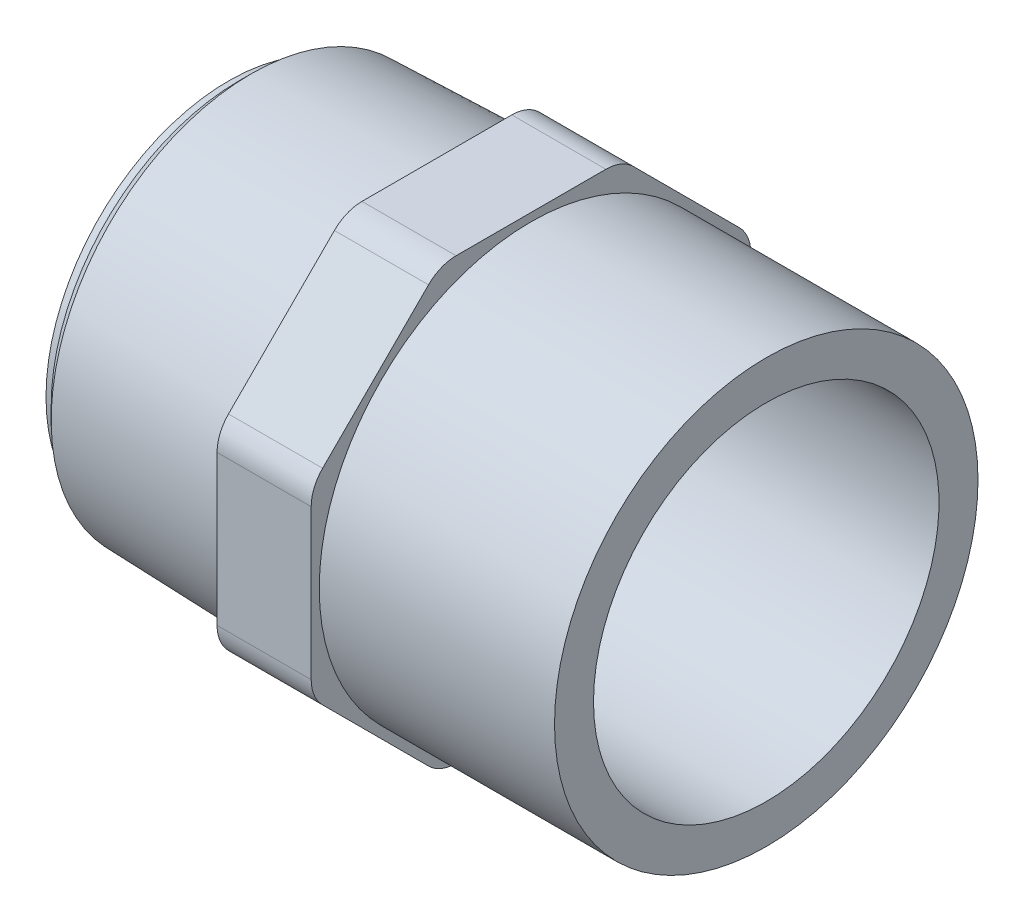
ISO-10303-21;
HEADER;
FILE_DESCRIPTION(('STEP AP214'),'2;1');
FILE_NAME('part.step','',(''),(''),'','','');
FILE_SCHEMA(('AUTOMOTIVE_DESIGN { 1 0 10303 214 1 1 1 1 }'));
ENDSEC;
DATA;
#1=APPLICATION_CONTEXT('core data for automotive mechanical design processes');
#2=APPLICATION_PROTOCOL_DEFINITION('international standard','automotive_design',2000,#1);
#3=PRODUCT_CONTEXT('',#1,'mechanical');
#4=PRODUCT('Part','Part','',(#3));
#5=PRODUCT_RELATED_PRODUCT_CATEGORY('part','',(#4));
#6=PRODUCT_DEFINITION_FORMATION('','',#4);
#7=PRODUCT_DEFINITION_CONTEXT('part definition',#1,'design');
#8=PRODUCT_DEFINITION('design','',#6,#7);
#9=PRODUCT_DEFINITION_SHAPE('','',#8);
#10=(LENGTH_UNIT() NAMED_UNIT(*) SI_UNIT(.MILLI.,.METRE.));
#11=(NAMED_UNIT(*) PLANE_ANGLE_UNIT() SI_UNIT($,.RADIAN.));
#12=(NAMED_UNIT(*) SI_UNIT($,.STERADIAN.) SOLID_ANGLE_UNIT());
#13=UNCERTAINTY_MEASURE_WITH_UNIT(LENGTH_MEASURE(1.E-05),#10,'distance_accuracy_value','');
#14=(GEOMETRIC_REPRESENTATION_CONTEXT(3) GLOBAL_UNCERTAINTY_ASSIGNED_CONTEXT((#13)) GLOBAL_UNIT_ASSIGNED_CONTEXT((#10,
#11,#12)) REPRESENTATION_CONTEXT('',''));
#15=CARTESIAN_POINT('',(0.,0.,0.));
#16=DIRECTION('',(0.,0.,1.));
#17=DIRECTION('',(1.,0.,0.));
#18=AXIS2_PLACEMENT_3D('',#15,#16,#17);
#19=CARTESIAN_POINT('',(-49.,-32.7,32.7));
#20=DIRECTION('',(-1.,0.,0.));
#21=DIRECTION('',(0.,1.,0.));
#22=AXIS2_PLACEMENT_3D('',#19,#20,#21);
#23=PLANE('',#22);
#24=CARTESIAN_POINT('',(-49.,0.,0.));
#25=DIRECTION('',(1.,0.,0.));
#26=DIRECTION('',(0.,0.,-1.));
#27=AXIS2_PLACEMENT_3D('',#24,#25,#26);
#28=CIRCLE('',#27,30.6172714934728);
#29=CARTESIAN_POINT('',(-49.,0.,-30.6172714934728));
#30=VERTEX_POINT('',#29);
#31=EDGE_CURVE('E18',#30,#30,#28,.F.);
#32=ORIENTED_EDGE('',*,*,#31,.F.);
#33=EDGE_LOOP('',(#32));
#34=FACE_BOUND('',#33,.T.);
#35=CARTESIAN_POINT('',(-49.,-26.8999999999999,11.1423448278362));
#36=DIRECTION('',(1.,0.,0.));
#37=DIRECTION('',(0.,0.,-1.));
#38=AXIS2_PLACEMENT_3D('',#35,#36,#37);
#39=CIRCLE('',#38,5.80000000000005);
#40=CARTESIAN_POINT('',(-49.,-31.001219330882,15.2435641587182));
#41=VERTEX_POINT('',#40);
#42=CARTESIAN_POINT('',(-49.,-32.7,11.1423448278362));
#43=VERTEX_POINT('',#42);
#44=EDGE_CURVE('E235',#41,#43,#39,.T.);
#45=ORIENTED_EDGE('',*,*,#44,.F.);
#46=DIRECTION('',(0.,-0.707106781186547,-0.707106781186548));
#47=VECTOR('',#46,1.);
#48=CARTESIAN_POINT('',(-49.,-23.1223917448001,23.1223917448001));
#49=LINE('',#48,#47);
#50=CARTESIAN_POINT('',(-49.,-15.2435641587182,31.001219330882));
#51=VERTEX_POINT('',#50);
#52=EDGE_CURVE('E132',#51,#41,#49,.T.);
#53=ORIENTED_EDGE('',*,*,#52,.F.);
#54=CARTESIAN_POINT('',(-49.,-11.1423448278363,26.9));
#55=DIRECTION('',(1.,0.,0.));
#56=DIRECTION('',(0.,0.,-1.));
#57=AXIS2_PLACEMENT_3D('',#54,#55,#56);
#58=CIRCLE('',#57,5.8);
#59=CARTESIAN_POINT('',(-49.,-11.1423448278363,32.7));
#60=VERTEX_POINT('',#59);
#61=EDGE_CURVE('E126',#60,#51,#58,.T.);
#62=ORIENTED_EDGE('',*,*,#61,.F.);
#63=DIRECTION('',(0.,-1.,0.));
#64=VECTOR('',#63,1.);
#65=CARTESIAN_POINT('',(-49.,0.,32.7));
#66=LINE('',#65,#64);
#67=CARTESIAN_POINT('',(-49.,11.1423448278362,32.7));
#68=VERTEX_POINT('',#67);
#69=EDGE_CURVE('E131',#68,#60,#66,.T.);
#70=ORIENTED_EDGE('',*,*,#69,.F.);
#71=CARTESIAN_POINT('',(-49.,11.1423448278362,26.9));
#72=DIRECTION('',(1.,0.,0.));
#73=DIRECTION('',(0.,0.,-1.));
#74=AXIS2_PLACEMENT_3D('',#71,#72,#73);
#75=CIRCLE('',#74,5.80000000000004);
#76=CARTESIAN_POINT('',(-49.,15.2435641587182,31.001219330882));
#77=VERTEX_POINT('',#76);
#78=EDGE_CURVE('E147',#77,#68,#75,.T.);
#79=ORIENTED_EDGE('',*,*,#78,.F.);
#80=DIRECTION('',(0.,-0.707106781186548,0.707106781186547));
#81=VECTOR('',#80,1.);
#82=CARTESIAN_POINT('',(-49.,23.1223917448001,23.1223917448001));
#83=LINE('',#82,#81);
#84=CARTESIAN_POINT('',(-49.,31.001219330882,15.2435641587182));
#85=VERTEX_POINT('',#84);
#86=EDGE_CURVE('E151',#85,#77,#83,.T.);
#87=ORIENTED_EDGE('',*,*,#86,.F.);
#88=CARTESIAN_POINT('',(-49.,26.9,11.1423448278363));
#89=DIRECTION('',(1.,0.,0.));
#90=DIRECTION('',(0.,0.,-1.));
#91=AXIS2_PLACEMENT_3D('',#88,#89,#90);
#92=CIRCLE('',#91,5.80000000000004);
#93=CARTESIAN_POINT('',(-49.,32.7,11.1423448278363));
#94=VERTEX_POINT('',#93);
#95=EDGE_CURVE('E225',#94,#85,#92,.T.);
#96=ORIENTED_EDGE('',*,*,#95,.F.);
#97=DIRECTION('',(0.,0.,1.));
#98=VECTOR('',#97,1.);
#99=CARTESIAN_POINT('',(-49.,32.7,0.));
#100=LINE('',#99,#98);
#101=CARTESIAN_POINT('',(-49.,32.7,-11.1423448278363));
#102=VERTEX_POINT('',#101);
#103=EDGE_CURVE('E155',#102,#94,#100,.T.);
#104=ORIENTED_EDGE('',*,*,#103,.F.);
#105=CARTESIAN_POINT('',(-49.,26.9,-11.1423448278363));
#106=DIRECTION('',(1.,0.,0.));
#107=DIRECTION('',(0.,0.,-1.));
#108=AXIS2_PLACEMENT_3D('',#105,#106,#107);
#109=CIRCLE('',#108,5.79999999999996);
#110=CARTESIAN_POINT('',(-49.,31.001219330882,-15.2435641587182));
#111=VERTEX_POINT('',#110);
#112=EDGE_CURVE('E227',#111,#102,#109,.T.);
#113=ORIENTED_EDGE('',*,*,#112,.F.);
#114=DIRECTION('',(0.,0.707106781186548,0.707106781186547));
#115=VECTOR('',#114,1.);
#116=CARTESIAN_POINT('',(-49.,23.1223917448001,-23.1223917448001));
#117=LINE('',#116,#115);
#118=CARTESIAN_POINT('',(-49.,15.2435641587182,-31.001219330882));
#119=VERTEX_POINT('',#118);
#120=EDGE_CURVE('E159',#119,#111,#117,.T.);
#121=ORIENTED_EDGE('',*,*,#120,.F.);
#122=CARTESIAN_POINT('',(-49.,11.1423448278362,-26.8999999999999));
#123=DIRECTION('',(1.,0.,0.));
#124=DIRECTION('',(0.,0.,-1.));
#125=AXIS2_PLACEMENT_3D('',#122,#123,#124);
#126=CIRCLE('',#125,5.80000000000007);
#127=CARTESIAN_POINT('',(-49.,11.1423448278363,-32.7));
#128=VERTEX_POINT('',#127);
#129=EDGE_CURVE('E229',#128,#119,#126,.T.);
#130=ORIENTED_EDGE('',*,*,#129,.F.);
#131=DIRECTION('',(0.,1.,0.));
#132=VECTOR('',#131,1.);
#133=CARTESIAN_POINT('',(-49.,0.,-32.7));
#134=LINE('',#133,#132);
#135=CARTESIAN_POINT('',(-49.,-11.1423448278363,-32.7));
#136=VERTEX_POINT('',#135);
#137=EDGE_CURVE('E163',#136,#128,#134,.T.);
#138=ORIENTED_EDGE('',*,*,#137,.F.);
#139=CARTESIAN_POINT('',(-49.,-11.1423448278363,-26.9));
#140=DIRECTION('',(1.,0.,0.));
#141=DIRECTION('',(0.,0.,-1.));
#142=AXIS2_PLACEMENT_3D('',#139,#140,#141);
#143=CIRCLE('',#142,5.79999999999998);
#144=CARTESIAN_POINT('',(-49.,-15.2435641587182,-31.001219330882));
#145=VERTEX_POINT('',#144);
#146=EDGE_CURVE('E231',#145,#136,#143,.T.);
#147=ORIENTED_EDGE('',*,*,#146,.F.);
#148=DIRECTION('',(0.,0.707106781186548,-0.707106781186548));
#149=VECTOR('',#148,1.);
#150=CARTESIAN_POINT('',(-49.,-23.1223917448001,-23.1223917448001));
#151=LINE('',#150,#149);
#152=CARTESIAN_POINT('',(-49.,-31.001219330882,-15.2435641587182));
#153=VERTEX_POINT('',#152);
#154=EDGE_CURVE('E167',#153,#145,#151,.T.);
#155=ORIENTED_EDGE('',*,*,#154,.F.);
#156=CARTESIAN_POINT('',(-49.,-26.9,-11.1423448278363));
#157=DIRECTION('',(1.,0.,0.));
#158=DIRECTION('',(0.,0.,-1.));
#159=AXIS2_PLACEMENT_3D('',#156,#157,#158);
#160=CIRCLE('',#159,5.79999999999997);
#161=CARTESIAN_POINT('',(-49.,-32.7,-11.1423448278363));
#162=VERTEX_POINT('',#161);
#163=EDGE_CURVE('E233',#162,#153,#160,.T.);
#164=ORIENTED_EDGE('',*,*,#163,.F.);
#165=DIRECTION('',(0.,0.,-1.));
#166=VECTOR('',#165,1.);
#167=CARTESIAN_POINT('',(-49.,-32.7,0.));
#168=LINE('',#167,#166);
#169=EDGE_CURVE('E171',#43,#162,#168,.T.);
#170=ORIENTED_EDGE('',*,*,#169,.F.);
#171=EDGE_LOOP('',(#45,#53,#62,#70,#79,#87,#96,#104,#113,#121,#130,#138,#147,#155,#164,#170));
#172=FACE_BOUND('',#171,.T.);
#173=ADVANCED_FACE('F15',(#34,#172),#23,.T.);
#174=CARTESIAN_POINT('',(-76.6230979570329,0.,0.));
#175=DIRECTION('',(1.,0.,0.));
#176=DIRECTION('',(0.,0.,-1.));
#177=AXIS2_PLACEMENT_3D('',#174,#175,#176);
#178=CONICAL_SURFACE('',#177,29.7569020429671,0.0311366738555793);
#179=CARTESIAN_POINT('',(-76.6230979570329,0.,0.));
#180=DIRECTION('',(-1.,0.,0.));
#181=DIRECTION('',(0.,1.,0.));
#182=AXIS2_PLACEMENT_3D('',#179,#180,#181);
#183=CIRCLE('',#182,29.7569020429671);
#184=CARTESIAN_POINT('',(-76.6230979570329,29.7569020429671,0.));
#185=VERTEX_POINT('',#184);
#186=EDGE_CURVE('E143',#185,#185,#183,.T.);
#187=ORIENTED_EDGE('',*,*,#186,.F.);
#188=EDGE_LOOP('',(#187));
#189=FACE_BOUND('',#188,.T.);
#190=ORIENTED_EDGE('',*,*,#31,.T.);
#191=EDGE_LOOP('',(#190));
#192=FACE_BOUND('',#191,.T.);
#193=ADVANCED_FACE('F537',(#189,#192),#178,.T.);
#194=CARTESIAN_POINT('',(-35.,-11.1423448278363,26.9));
#195=DIRECTION('',(1.,0.,0.));
#196=DIRECTION('',(0.,0.,-1.));
#197=AXIS2_PLACEMENT_3D('',#194,#195,#196);
#198=CYLINDRICAL_SURFACE('',#197,5.8);
#199=ORIENTED_EDGE('',*,*,#61,.T.);
#200=DIRECTION('',(1.,0.,0.));
#201=VECTOR('',#200,1.);
#202=CARTESIAN_POINT('',(-49.,-15.2435641587182,31.001219330882));
#203=LINE('',#202,#201);
#204=CARTESIAN_POINT('',(-35.,-15.2435641587182,31.001219330882));
#205=VERTEX_POINT('',#204);
#206=EDGE_CURVE('E135',#205,#51,#203,.F.);
#207=ORIENTED_EDGE('',*,*,#206,.F.);
#208=CARTESIAN_POINT('',(-35.,-11.1423448278363,26.9));
#209=DIRECTION('',(1.,0.,0.));
#210=DIRECTION('',(0.,0.,-1.));
#211=AXIS2_PLACEMENT_3D('',#208,#209,#210);
#212=CIRCLE('',#211,5.8);
#213=CARTESIAN_POINT('',(-35.,-11.1423448278363,32.7));
#214=VERTEX_POINT('',#213);
#215=EDGE_CURVE('E140',#214,#205,#212,.T.);
#216=ORIENTED_EDGE('',*,*,#215,.F.);
#217=DIRECTION('',(1.,0.,0.));
#218=VECTOR('',#217,1.);
#219=CARTESIAN_POINT('',(-49.,-11.1423448278363,32.7));
#220=LINE('',#219,#218);
#221=EDGE_CURVE('E137',#60,#214,#220,.T.);
#222=ORIENTED_EDGE('',*,*,#221,.F.);
#223=EDGE_LOOP('',(#199,#207,#216,#222));
#224=FACE_BOUND('',#223,.T.);
#225=ADVANCED_FACE('F138',(#224),#198,.T.);
#226=CARTESIAN_POINT('',(-49.,-15.2435641587182,31.001219330882));
#227=DIRECTION('',(0.,-0.707106781186548,0.707106781186547));
#228=DIRECTION('',(0.,-0.707106781186547,-0.707106781186548));
#229=AXIS2_PLACEMENT_3D('',#226,#227,#228);
#230=PLANE('',#229);
#231=ORIENTED_EDGE('',*,*,#52,.T.);
#232=DIRECTION('',(-1.,0.,0.));
#233=VECTOR('',#232,1.);
#234=CARTESIAN_POINT('',(-42.,-31.001219330882,15.2435641587182));
#235=LINE('',#234,#233);
#236=CARTESIAN_POINT('',(-35.,-31.001219330882,15.2435641587182));
#237=VERTEX_POINT('',#236);
#238=EDGE_CURVE('E175',#237,#41,#235,.T.);
#239=ORIENTED_EDGE('',*,*,#238,.F.);
#240=CARTESIAN_POINT('',(-35.,-15.2435641587182,31.001219330882));
#241=CARTESIAN_POINT('',(-35.,-15.9001331242251,30.3446503653751));
#242=CARTESIAN_POINT('',(-35.,-16.5567020897319,29.6880813998683));
#243=CARTESIAN_POINT('',(-35.,-17.8698400207455,28.3749434688547));
#244=CARTESIAN_POINT('',(-35.,-18.5264089862523,27.7183745033479));
#245=CARTESIAN_POINT('',(-35.,-19.839546917266,26.4052365723342));
#246=CARTESIAN_POINT('',(-35.,-20.4961158827728,25.7486676068274));
#247=CARTESIAN_POINT('',(-35.,-21.8092538137865,24.4355296758137));
#248=CARTESIAN_POINT('',(-35.,-22.4658227792933,23.7789607103069));
#249=CARTESIAN_POINT('',(-35.,-23.7789607103069,22.4658227792933));
#250=CARTESIAN_POINT('',(-35.,-24.4355296758137,21.8092538137864));
#251=CARTESIAN_POINT('',(-35.,-25.7486676068274,20.4961158827728));
#252=CARTESIAN_POINT('',(-35.,-26.4052365723342,19.839546917266));
#253=CARTESIAN_POINT('',(-35.,-27.7183745033478,18.5264089862523));
#254=CARTESIAN_POINT('',(-35.,-28.3749434688547,17.8698400207455));
#255=CARTESIAN_POINT('',(-35.,-29.6880813998683,16.5567020897319));
#256=CARTESIAN_POINT('',(-35.,-30.3446503653751,15.900133124225));
#257=CARTESIAN_POINT('',(-35.,-31.001219330882,15.2435641587182));
#258=B_SPLINE_CURVE_WITH_KNOTS('',3,(#240,#241,#242,#243,#244,#245,#246,#247,#248,#249,#250,
#251,#252,#253,#254,#255,#256,#257),.UNSPECIFIED.,.F.,.F.,(4,2,2,2,2,2,2,2,4),(0.,
2.78558620695906,5.57117241391813,8.35675862087719,11.1423448278363,13.9279310347953,
16.7135172417544,19.4991034487134,22.2846896556725),.UNSPECIFIED.);
#259=EDGE_CURVE('E222',#205,#237,#258,.T.);
#260=ORIENTED_EDGE('',*,*,#259,.F.);
#261=ORIENTED_EDGE('',*,*,#206,.T.);
#262=EDGE_LOOP('',(#231,#239,#260,#261));
#263=FACE_BOUND('',#262,.T.);
#264=ADVANCED_FACE('F369',(#263),#230,.T.);
#265=CARTESIAN_POINT('',(-35.,-26.8999999999999,11.1423448278362));
#266=DIRECTION('',(1.,0.,0.));
#267=DIRECTION('',(0.,0.,-1.));
#268=AXIS2_PLACEMENT_3D('',#265,#266,#267);
#269=CYLINDRICAL_SURFACE('',#268,5.80000000000005);
#270=ORIENTED_EDGE('',*,*,#44,.T.);
#271=DIRECTION('',(1.,0.,0.));
#272=VECTOR('',#271,1.);
#273=CARTESIAN_POINT('',(-49.,-32.7,11.1423448278362));
#274=LINE('',#273,#272);
#275=CARTESIAN_POINT('',(-35.,-32.7,11.1423448278362));
#276=VERTEX_POINT('',#275);
#277=EDGE_CURVE('E174',#276,#43,#274,.F.);
#278=ORIENTED_EDGE('',*,*,#277,.F.);
#279=CARTESIAN_POINT('',(-35.,-26.8999999999999,11.1423448278362));
#280=DIRECTION('',(1.,0.,0.));
#281=DIRECTION('',(0.,0.,-1.));
#282=AXIS2_PLACEMENT_3D('',#279,#280,#281);
#283=CIRCLE('',#282,5.80000000000005);
#284=EDGE_CURVE('E219',#237,#276,#283,.T.);
#285=ORIENTED_EDGE('',*,*,#284,.F.);
#286=ORIENTED_EDGE('',*,*,#238,.T.);
#287=EDGE_LOOP('',(#270,#278,#285,#286));
#288=FACE_BOUND('',#287,.T.);
#289=ADVANCED_FACE('F370',(#288),#269,.T.);
#290=CARTESIAN_POINT('',(-49.,-32.7,11.1423448278362));
#291=DIRECTION('',(0.,-1.,0.));
#292=DIRECTION('',(0.,0.,-1.));
#293=AXIS2_PLACEMENT_3D('',#290,#291,#292);
#294=PLANE('',#293);
#295=ORIENTED_EDGE('',*,*,#169,.T.);
#296=DIRECTION('',(-1.,0.,0.));
#297=VECTOR('',#296,1.);
#298=CARTESIAN_POINT('',(-42.,-32.7,-11.1423448278363));
#299=LINE('',#298,#297);
#300=CARTESIAN_POINT('',(-35.,-32.7,-11.1423448278363));
#301=VERTEX_POINT('',#300);
#302=EDGE_CURVE('E173',#301,#162,#299,.T.);
#303=ORIENTED_EDGE('',*,*,#302,.F.);
#304=DIRECTION('',(0.,0.,-1.));
#305=VECTOR('',#304,1.);
#306=CARTESIAN_POINT('',(-35.,-32.7,32.7));
#307=LINE('',#306,#305);
#308=EDGE_CURVE('E218',#276,#301,#307,.T.);
#309=ORIENTED_EDGE('',*,*,#308,.F.);
#310=ORIENTED_EDGE('',*,*,#277,.T.);
#311=EDGE_LOOP('',(#295,#303,#309,#310));
#312=FACE_BOUND('',#311,.T.);
#313=ADVANCED_FACE('F326',(#312),#294,.T.);
#314=CARTESIAN_POINT('',(-35.,-26.9,-11.1423448278363));
#315=DIRECTION('',(1.,0.,0.));
#316=DIRECTION('',(0.,0.,-1.));
#317=AXIS2_PLACEMENT_3D('',#314,#315,#316);
#318=CYLINDRICAL_SURFACE('',#317,5.79999999999997);
#319=ORIENTED_EDGE('',*,*,#163,.T.);
#320=DIRECTION('',(1.,0.,0.));
#321=VECTOR('',#320,1.);
#322=CARTESIAN_POINT('',(-49.,-31.001219330882,-15.2435641587182));
#323=LINE('',#322,#321);
#324=CARTESIAN_POINT('',(-35.,-31.001219330882,-15.2435641587182));
#325=VERTEX_POINT('',#324);
#326=EDGE_CURVE('E170',#325,#153,#323,.F.);
#327=ORIENTED_EDGE('',*,*,#326,.F.);
#328=CARTESIAN_POINT('',(-35.,-26.9,-11.1423448278363));
#329=DIRECTION('',(1.,0.,0.));
#330=DIRECTION('',(0.,0.,-1.));
#331=AXIS2_PLACEMENT_3D('',#328,#329,#330);
#332=CIRCLE('',#331,5.79999999999997);
#333=EDGE_CURVE('E215',#301,#325,#332,.T.);
#334=ORIENTED_EDGE('',*,*,#333,.F.);
#335=ORIENTED_EDGE('',*,*,#302,.T.);
#336=EDGE_LOOP('',(#319,#327,#334,#335));
#337=FACE_BOUND('',#336,.T.);
#338=ADVANCED_FACE('F329',(#337),#318,.T.);
#339=CARTESIAN_POINT('',(-49.,-31.001219330882,-15.2435641587182));
#340=DIRECTION('',(0.,-0.707106781186547,-0.707106781186547));
#341=DIRECTION('',(0.,0.707106781186547,-0.707106781186547));
#342=AXIS2_PLACEMENT_3D('',#339,#340,#341);
#343=PLANE('',#342);
#344=ORIENTED_EDGE('',*,*,#154,.T.);
#345=DIRECTION('',(-1.,0.,0.));
#346=VECTOR('',#345,1.);
#347=CARTESIAN_POINT('',(-42.,-15.2435641587182,-31.001219330882));
#348=LINE('',#347,#346);
#349=CARTESIAN_POINT('',(-35.,-15.2435641587182,-31.001219330882));
#350=VERTEX_POINT('',#349);
#351=EDGE_CURVE('E169',#350,#145,#348,.T.);
#352=ORIENTED_EDGE('',*,*,#351,.F.);
#353=CARTESIAN_POINT('',(-35.,-31.001219330882,-15.2435641587182));
#354=CARTESIAN_POINT('',(-35.,-30.3446503653751,-15.9001331242251));
#355=CARTESIAN_POINT('',(-35.,-29.6880813998683,-16.5567020897319));
#356=CARTESIAN_POINT('',(-35.,-28.3749434688547,-17.8698400207455));
#357=CARTESIAN_POINT('',(-35.,-27.7183745033478,-18.5264089862524));
#358=CARTESIAN_POINT('',(-35.,-26.4052365723342,-19.839546917266));
#359=CARTESIAN_POINT('',(-35.,-25.7486676068274,-20.4961158827728));
#360=CARTESIAN_POINT('',(-35.,-24.4355296758137,-21.8092538137865));
#361=CARTESIAN_POINT('',(-35.,-23.7789607103069,-22.4658227792933));
#362=CARTESIAN_POINT('',(-35.,-22.4658227792933,-23.7789607103069));
#363=CARTESIAN_POINT('',(-35.,-21.8092538137864,-24.4355296758138));
#364=CARTESIAN_POINT('',(-35.,-20.4961158827728,-25.7486676068274));
#365=CARTESIAN_POINT('',(-35.,-19.839546917266,-26.4052365723342));
#366=CARTESIAN_POINT('',(-35.,-18.5264089862523,-27.7183745033479));
#367=CARTESIAN_POINT('',(-35.,-17.8698400207455,-28.3749434688547));
#368=CARTESIAN_POINT('',(-35.,-16.5567020897319,-29.6880813998683));
#369=CARTESIAN_POINT('',(-35.,-15.900133124225,-30.3446503653751));
#370=CARTESIAN_POINT('',(-35.,-15.2435641587182,-31.001219330882));
#371=B_SPLINE_CURVE_WITH_KNOTS('',3,(#353,#354,#355,#356,#357,#358,#359,#360,#361,#362,#363,
#364,#365,#366,#367,#368,#369,#370),.UNSPECIFIED.,.F.,.F.,(4,2,2,2,2,2,2,2,4),(0.,
2.78558620695906,5.57117241391813,8.35675862087718,11.1423448278362,13.9279310347953,
16.7135172417544,19.4991034487134,22.2846896556725),.UNSPECIFIED.);
#372=EDGE_CURVE('E214',#325,#350,#371,.T.);
#373=ORIENTED_EDGE('',*,*,#372,.F.);
#374=ORIENTED_EDGE('',*,*,#326,.T.);
#375=EDGE_LOOP('',(#344,#352,#373,#374));
#376=FACE_BOUND('',#375,.T.);
#377=ADVANCED_FACE('F333',(#376),#343,.T.);
#378=CARTESIAN_POINT('',(-35.,-11.1423448278363,-26.9));
#379=DIRECTION('',(1.,0.,0.));
#380=DIRECTION('',(0.,0.,-1.));
#381=AXIS2_PLACEMENT_3D('',#378,#379,#380);
#382=CYLINDRICAL_SURFACE('',#381,5.79999999999998);
#383=ORIENTED_EDGE('',*,*,#146,.T.);
#384=DIRECTION('',(1.,0.,0.));
#385=VECTOR('',#384,1.);
#386=CARTESIAN_POINT('',(-49.,-11.1423448278363,-32.7));
#387=LINE('',#386,#385);
#388=CARTESIAN_POINT('',(-35.,-11.1423448278363,-32.7));
#389=VERTEX_POINT('',#388);
#390=EDGE_CURVE('E166',#389,#136,#387,.F.);
#391=ORIENTED_EDGE('',*,*,#390,.F.);
#392=CARTESIAN_POINT('',(-35.,-11.1423448278363,-26.9));
#393=DIRECTION('',(1.,0.,0.));
#394=DIRECTION('',(0.,0.,-1.));
#395=AXIS2_PLACEMENT_3D('',#392,#393,#394);
#396=CIRCLE('',#395,5.79999999999998);
#397=EDGE_CURVE('E211',#350,#389,#396,.T.);
#398=ORIENTED_EDGE('',*,*,#397,.F.);
#399=ORIENTED_EDGE('',*,*,#351,.T.);
#400=EDGE_LOOP('',(#383,#391,#398,#399));
#401=FACE_BOUND('',#400,.T.);
#402=ADVANCED_FACE('F337',(#401),#382,.T.);
#403=CARTESIAN_POINT('',(-49.,-11.1423448278363,-32.7));
#404=DIRECTION('',(0.,0.,-1.));
#405=DIRECTION('',(0.,1.,0.));
#406=AXIS2_PLACEMENT_3D('',#403,#404,#405);
#407=PLANE('',#406);
#408=ORIENTED_EDGE('',*,*,#137,.T.);
#409=DIRECTION('',(-1.,0.,0.));
#410=VECTOR('',#409,1.);
#411=CARTESIAN_POINT('',(-42.,11.1423448278363,-32.7));
#412=LINE('',#411,#410);
#413=CARTESIAN_POINT('',(-35.,11.1423448278363,-32.7));
#414=VERTEX_POINT('',#413);
#415=EDGE_CURVE('E165',#414,#128,#412,.T.);
#416=ORIENTED_EDGE('',*,*,#415,.F.);
#417=DIRECTION('',(0.,1.,0.));
#418=VECTOR('',#417,1.);
#419=CARTESIAN_POINT('',(-35.,0.,-32.7));
#420=LINE('',#419,#418);
#421=EDGE_CURVE('E210',#389,#414,#420,.T.);
#422=ORIENTED_EDGE('',*,*,#421,.F.);
#423=ORIENTED_EDGE('',*,*,#390,.T.);
#424=EDGE_LOOP('',(#408,#416,#422,#423));
#425=FACE_BOUND('',#424,.T.);
#426=ADVANCED_FACE('F341',(#425),#407,.T.);
#427=CARTESIAN_POINT('',(-35.,11.1423448278362,-26.8999999999999));
#428=DIRECTION('',(1.,0.,0.));
#429=DIRECTION('',(0.,0.,-1.));
#430=AXIS2_PLACEMENT_3D('',#427,#428,#429);
#431=CYLINDRICAL_SURFACE('',#430,5.80000000000007);
#432=ORIENTED_EDGE('',*,*,#129,.T.);
#433=DIRECTION('',(1.,0.,0.));
#434=VECTOR('',#433,1.);
#435=CARTESIAN_POINT('',(-49.,15.2435641587182,-31.001219330882));
#436=LINE('',#435,#434);
#437=CARTESIAN_POINT('',(-35.,15.2435641587182,-31.001219330882));
#438=VERTEX_POINT('',#437);
#439=EDGE_CURVE('E162',#438,#119,#436,.F.);
#440=ORIENTED_EDGE('',*,*,#439,.F.);
#441=CARTESIAN_POINT('',(-35.,11.1423448278362,-26.8999999999999));
#442=DIRECTION('',(1.,0.,0.));
#443=DIRECTION('',(0.,0.,-1.));
#444=AXIS2_PLACEMENT_3D('',#441,#442,#443);
#445=CIRCLE('',#444,5.80000000000007);
#446=EDGE_CURVE('E207',#414,#438,#445,.T.);
#447=ORIENTED_EDGE('',*,*,#446,.F.);
#448=ORIENTED_EDGE('',*,*,#415,.T.);
#449=EDGE_LOOP('',(#432,#440,#447,#448));
#450=FACE_BOUND('',#449,.T.);
#451=ADVANCED_FACE('F345',(#450),#431,.T.);
#452=CARTESIAN_POINT('',(-49.,15.2435641587182,-31.001219330882));
#453=DIRECTION('',(0.,0.707106781186547,-0.707106781186548));
#454=DIRECTION('',(0.,0.707106781186548,0.707106781186547));
#455=AXIS2_PLACEMENT_3D('',#452,#453,#454);
#456=PLANE('',#455);
#457=ORIENTED_EDGE('',*,*,#120,.T.);
#458=DIRECTION('',(-1.,0.,0.));
#459=VECTOR('',#458,1.);
#460=CARTESIAN_POINT('',(-42.,31.001219330882,-15.2435641587182));
#461=LINE('',#460,#459);
#462=CARTESIAN_POINT('',(-35.,31.001219330882,-15.2435641587182));
#463=VERTEX_POINT('',#462);
#464=EDGE_CURVE('E161',#463,#111,#461,.T.);
#465=ORIENTED_EDGE('',*,*,#464,.F.);
#466=CARTESIAN_POINT('',(-35.,15.2435641587182,-31.001219330882));
#467=CARTESIAN_POINT('',(-35.,15.9001331242251,-30.3446503653752));
#468=CARTESIAN_POINT('',(-35.,16.5567020897319,-29.6880813998683));
#469=CARTESIAN_POINT('',(-35.,17.8698400207455,-28.3749434688547));
#470=CARTESIAN_POINT('',(-35.,18.5264089862523,-27.7183745033479));
#471=CARTESIAN_POINT('',(-35.,19.839546917266,-26.4052365723342));
#472=CARTESIAN_POINT('',(-35.,20.4961158827728,-25.7486676068274));
#473=CARTESIAN_POINT('',(-35.,21.8092538137865,-24.4355296758137));
#474=CARTESIAN_POINT('',(-35.,22.4658227792933,-23.7789607103069));
#475=CARTESIAN_POINT('',(-35.,23.7789607103069,-22.4658227792933));
#476=CARTESIAN_POINT('',(-35.,24.4355296758137,-21.8092538137864));
#477=CARTESIAN_POINT('',(-35.,25.7486676068274,-20.4961158827728));
#478=CARTESIAN_POINT('',(-35.,26.4052365723342,-19.839546917266));
#479=CARTESIAN_POINT('',(-35.,27.7183745033479,-18.5264089862523));
#480=CARTESIAN_POINT('',(-35.,28.3749434688547,-17.8698400207455));
#481=CARTESIAN_POINT('',(-35.,29.6880813998683,-16.5567020897319));
#482=CARTESIAN_POINT('',(-35.,30.3446503653751,-15.900133124225));
#483=CARTESIAN_POINT('',(-35.,31.001219330882,-15.2435641587182));
#484=B_SPLINE_CURVE_WITH_KNOTS('',3,(#466,#467,#468,#469,#470,#471,#472,#473,#474,#475,#476,
#477,#478,#479,#480,#481,#482,#483),.UNSPECIFIED.,.F.,.F.,(4,2,2,2,2,2,2,2,4),(0.,
2.78558620695906,5.57117241391812,8.35675862087719,11.1423448278363,13.9279310347953,
16.7135172417544,19.4991034487135,22.2846896556725),.UNSPECIFIED.);
#485=EDGE_CURVE('E206',#438,#463,#484,.T.);
#486=ORIENTED_EDGE('',*,*,#485,.F.);
#487=ORIENTED_EDGE('',*,*,#439,.T.);
#488=EDGE_LOOP('',(#457,#465,#486,#487));
#489=FACE_BOUND('',#488,.T.);
#490=ADVANCED_FACE('F349',(#489),#456,.T.);
#491=CARTESIAN_POINT('',(-35.,26.9,-11.1423448278363));
#492=DIRECTION('',(1.,0.,0.));
#493=DIRECTION('',(0.,0.,-1.));
#494=AXIS2_PLACEMENT_3D('',#491,#492,#493);
#495=CYLINDRICAL_SURFACE('',#494,5.79999999999996);
#496=ORIENTED_EDGE('',*,*,#112,.T.);
#497=DIRECTION('',(1.,0.,0.));
#498=VECTOR('',#497,1.);
#499=CARTESIAN_POINT('',(-49.,32.7,-11.1423448278363));
#500=LINE('',#499,#498);
#501=CARTESIAN_POINT('',(-35.,32.7,-11.1423448278363));
#502=VERTEX_POINT('',#501);
#503=EDGE_CURVE('E158',#502,#102,#500,.F.);
#504=ORIENTED_EDGE('',*,*,#503,.F.);
#505=CARTESIAN_POINT('',(-35.,26.9,-11.1423448278363));
#506=DIRECTION('',(1.,0.,0.));
#507=DIRECTION('',(0.,0.,-1.));
#508=AXIS2_PLACEMENT_3D('',#505,#506,#507);
#509=CIRCLE('',#508,5.79999999999996);
#510=EDGE_CURVE('E203',#463,#502,#509,.T.);
#511=ORIENTED_EDGE('',*,*,#510,.F.);
#512=ORIENTED_EDGE('',*,*,#464,.T.);
#513=EDGE_LOOP('',(#496,#504,#511,#512));
#514=FACE_BOUND('',#513,.T.);
#515=ADVANCED_FACE('F353',(#514),#495,.T.);
#516=CARTESIAN_POINT('',(-49.,32.7,-11.1423448278363));
#517=DIRECTION('',(0.,1.,0.));
#518=DIRECTION('',(0.,0.,1.));
#519=AXIS2_PLACEMENT_3D('',#516,#517,#518);
#520=PLANE('',#519);
#521=ORIENTED_EDGE('',*,*,#103,.T.);
#522=DIRECTION('',(-1.,0.,0.));
#523=VECTOR('',#522,1.);
#524=CARTESIAN_POINT('',(-42.,32.7,11.1423448278363));
#525=LINE('',#524,#523);
#526=CARTESIAN_POINT('',(-35.,32.7,11.1423448278363));
#527=VERTEX_POINT('',#526);
#528=EDGE_CURVE('E157',#527,#94,#525,.T.);
#529=ORIENTED_EDGE('',*,*,#528,.F.);
#530=DIRECTION('',(0.,0.,-1.));
#531=VECTOR('',#530,1.);
#532=CARTESIAN_POINT('',(-35.,32.7,32.7));
#533=LINE('',#532,#531);
#534=EDGE_CURVE('E202',#502,#527,#533,.F.);
#535=ORIENTED_EDGE('',*,*,#534,.F.);
#536=ORIENTED_EDGE('',*,*,#503,.T.);
#537=EDGE_LOOP('',(#521,#529,#535,#536));
#538=FACE_BOUND('',#537,.T.);
#539=ADVANCED_FACE('F357',(#538),#520,.T.);
#540=CARTESIAN_POINT('',(-35.,26.9,11.1423448278363));
#541=DIRECTION('',(1.,0.,0.));
#542=DIRECTION('',(0.,0.,-1.));
#543=AXIS2_PLACEMENT_3D('',#540,#541,#542);
#544=CYLINDRICAL_SURFACE('',#543,5.80000000000004);
#545=ORIENTED_EDGE('',*,*,#95,.T.);
#546=DIRECTION('',(1.,0.,0.));
#547=VECTOR('',#546,1.);
#548=CARTESIAN_POINT('',(-49.,31.001219330882,15.2435641587182));
#549=LINE('',#548,#547);
#550=CARTESIAN_POINT('',(-35.,31.001219330882,15.2435641587182));
#551=VERTEX_POINT('',#550);
#552=EDGE_CURVE('E154',#551,#85,#549,.F.);
#553=ORIENTED_EDGE('',*,*,#552,.F.);
#554=CARTESIAN_POINT('',(-35.,26.9,11.1423448278363));
#555=DIRECTION('',(1.,0.,0.));
#556=DIRECTION('',(0.,0.,-1.));
#557=AXIS2_PLACEMENT_3D('',#554,#555,#556);
#558=CIRCLE('',#557,5.80000000000004);
#559=EDGE_CURVE('E199',#527,#551,#558,.T.);
#560=ORIENTED_EDGE('',*,*,#559,.F.);
#561=ORIENTED_EDGE('',*,*,#528,.T.);
#562=EDGE_LOOP('',(#545,#553,#560,#561));
#563=FACE_BOUND('',#562,.T.);
#564=ADVANCED_FACE('F361',(#563),#544,.T.);
#565=CARTESIAN_POINT('',(-49.,31.001219330882,15.2435641587182));
#566=DIRECTION('',(0.,0.707106781186547,0.707106781186548));
#567=DIRECTION('',(0.,-0.707106781186548,0.707106781186547));
#568=AXIS2_PLACEMENT_3D('',#565,#566,#567);
#569=PLANE('',#568);
#570=ORIENTED_EDGE('',*,*,#86,.T.);
#571=DIRECTION('',(-1.,0.,0.));
#572=VECTOR('',#571,1.);
#573=CARTESIAN_POINT('',(-42.,15.2435641587182,31.001219330882));
#574=LINE('',#573,#572);
#575=CARTESIAN_POINT('',(-35.,15.2435641587182,31.001219330882));
#576=VERTEX_POINT('',#575);
#577=EDGE_CURVE('E153',#576,#77,#574,.T.);
#578=ORIENTED_EDGE('',*,*,#577,.F.);
#579=CARTESIAN_POINT('',(-35.,31.001219330882,15.2435641587182));
#580=CARTESIAN_POINT('',(-35.,30.3446503653752,15.9001331242251));
#581=CARTESIAN_POINT('',(-35.,29.6880813998683,16.5567020897319));
#582=CARTESIAN_POINT('',(-35.,28.3749434688547,17.8698400207455));
#583=CARTESIAN_POINT('',(-35.,27.7183745033479,18.5264089862523));
#584=CARTESIAN_POINT('',(-35.,26.4052365723342,19.839546917266));
#585=CARTESIAN_POINT('',(-35.,25.7486676068274,20.4961158827728));
#586=CARTESIAN_POINT('',(-35.,24.4355296758138,21.8092538137865));
#587=CARTESIAN_POINT('',(-35.,23.7789607103069,22.4658227792933));
#588=CARTESIAN_POINT('',(-35.,22.4658227792933,23.7789607103069));
#589=CARTESIAN_POINT('',(-35.,21.8092538137865,24.4355296758138));
#590=CARTESIAN_POINT('',(-35.,20.4961158827728,25.7486676068274));
#591=CARTESIAN_POINT('',(-35.,19.839546917266,26.4052365723342));
#592=CARTESIAN_POINT('',(-35.,18.5264089862524,27.7183745033479));
#593=CARTESIAN_POINT('',(-35.,17.8698400207455,28.3749434688547));
#594=CARTESIAN_POINT('',(-35.,16.5567020897319,29.6880813998683));
#595=CARTESIAN_POINT('',(-35.,15.9001331242251,30.3446503653752));
#596=CARTESIAN_POINT('',(-35.,15.2435641587182,31.001219330882));
#597=B_SPLINE_CURVE_WITH_KNOTS('',3,(#579,#580,#581,#582,#583,#584,#585,#586,#587,#588,#589,
#590,#591,#592,#593,#594,#595,#596),.UNSPECIFIED.,.F.,.F.,(4,2,2,2,2,2,2,2,4),(0.,
2.78558620695906,5.57117241391812,8.35675862087719,11.1423448278363,13.9279310347953,
16.7135172417544,19.4991034487134,22.2846896556725),.UNSPECIFIED.);
#598=EDGE_CURVE('E198',#551,#576,#597,.T.);
#599=ORIENTED_EDGE('',*,*,#598,.F.);
#600=ORIENTED_EDGE('',*,*,#552,.T.);
#601=EDGE_LOOP('',(#570,#578,#599,#600));
#602=FACE_BOUND('',#601,.T.);
#603=ADVANCED_FACE('F365',(#602),#569,.T.);
#604=CARTESIAN_POINT('',(-35.,11.1423448278362,26.9));
#605=DIRECTION('',(1.,0.,0.));
#606=DIRECTION('',(0.,0.,-1.));
#607=AXIS2_PLACEMENT_3D('',#604,#605,#606);
#608=CYLINDRICAL_SURFACE('',#607,5.80000000000004);
#609=ORIENTED_EDGE('',*,*,#78,.T.);
#610=DIRECTION('',(1.,0.,0.));
#611=VECTOR('',#610,1.);
#612=CARTESIAN_POINT('',(-49.,11.1423448278363,32.7));
#613=LINE('',#612,#611);
#614=CARTESIAN_POINT('',(-35.,11.1423448278362,32.7));
#615=VERTEX_POINT('',#614);
#616=EDGE_CURVE('E33',#615,#68,#613,.F.);
#617=ORIENTED_EDGE('',*,*,#616,.F.);
#618=CARTESIAN_POINT('',(-35.,11.1423448278362,26.9));
#619=DIRECTION('',(1.,0.,0.));
#620=DIRECTION('',(0.,0.,-1.));
#621=AXIS2_PLACEMENT_3D('',#618,#619,#620);
#622=CIRCLE('',#621,5.80000000000004);
#623=EDGE_CURVE('E195',#576,#615,#622,.T.);
#624=ORIENTED_EDGE('',*,*,#623,.F.);
#625=ORIENTED_EDGE('',*,*,#577,.T.);
#626=EDGE_LOOP('',(#609,#617,#624,#625));
#627=FACE_BOUND('',#626,.T.);
#628=ADVANCED_FACE('F366',(#627),#608,.T.);
#629=CARTESIAN_POINT('',(-49.,11.1423448278363,32.7));
#630=DIRECTION('',(0.,0.,1.));
#631=DIRECTION('',(0.,-1.,0.));
#632=AXIS2_PLACEMENT_3D('',#629,#630,#631);
#633=PLANE('',#632);
#634=ORIENTED_EDGE('',*,*,#69,.T.);
#635=ORIENTED_EDGE('',*,*,#221,.T.);
#636=DIRECTION('',(0.,-1.,0.));
#637=VECTOR('',#636,1.);
#638=CARTESIAN_POINT('',(-35.,0.,32.7));
#639=LINE('',#638,#637);
#640=EDGE_CURVE('E194',#615,#214,#639,.T.);
#641=ORIENTED_EDGE('',*,*,#640,.F.);
#642=ORIENTED_EDGE('',*,*,#616,.T.);
#643=EDGE_LOOP('',(#634,#635,#641,#642));
#644=FACE_BOUND('',#643,.T.);
#645=ADVANCED_FACE('F145',(#644),#633,.T.);
#646=CARTESIAN_POINT('',(-78.45,0.,0.));
#647=DIRECTION('',(1.,0.,0.));
#648=DIRECTION('',(0.,0.,-1.));
#649=AXIS2_PLACEMENT_3D('',#646,#647,#648);
#650=CONICAL_SURFACE('',#649,27.93,0.78539816339745);
#651=CARTESIAN_POINT('',(-78.45,0.,0.));
#652=DIRECTION('',(1.,0.,0.));
#653=DIRECTION('',(0.,0.,-1.));
#654=AXIS2_PLACEMENT_3D('',#651,#652,#653);
#655=CIRCLE('',#654,27.93);
#656=CARTESIAN_POINT('',(-78.45,0.,-27.93));
#657=VERTEX_POINT('',#656);
#658=EDGE_CURVE('E191',#657,#657,#655,.F.);
#659=ORIENTED_EDGE('',*,*,#658,.F.);
#660=EDGE_LOOP('',(#659));
#661=FACE_BOUND('',#660,.T.);
#662=ORIENTED_EDGE('',*,*,#186,.T.);
#663=EDGE_LOOP('',(#662));
#664=FACE_BOUND('',#663,.T.);
#665=ADVANCED_FACE('F412',(#661,#664),#650,.T.);
#666=CARTESIAN_POINT('',(-35.,32.7,32.7));
#667=DIRECTION('',(1.,0.,0.));
#668=DIRECTION('',(0.,-1.,0.));
#669=AXIS2_PLACEMENT_3D('',#666,#667,#668);
#670=PLANE('',#669);
#671=CARTESIAN_POINT('',(-35.,0.,0.));
#672=DIRECTION('',(-1.,0.,0.));
#673=DIRECTION('',(0.,0.,1.));
#674=AXIS2_PLACEMENT_3D('',#671,#672,#673);
#675=CIRCLE('',#674,31.5);
#676=CARTESIAN_POINT('',(-35.,0.,31.5));
#677=VERTEX_POINT('',#676);
#678=EDGE_CURVE('E188',#677,#677,#675,.F.);
#679=ORIENTED_EDGE('',*,*,#678,.F.);
#680=EDGE_LOOP('',(#679));
#681=FACE_BOUND('',#680,.T.);
#682=ORIENTED_EDGE('',*,*,#623,.T.);
#683=ORIENTED_EDGE('',*,*,#640,.T.);
#684=ORIENTED_EDGE('',*,*,#215,.T.);
#685=ORIENTED_EDGE('',*,*,#259,.T.);
#686=ORIENTED_EDGE('',*,*,#284,.T.);
#687=ORIENTED_EDGE('',*,*,#308,.T.);
#688=ORIENTED_EDGE('',*,*,#333,.T.);
#689=ORIENTED_EDGE('',*,*,#372,.T.);
#690=ORIENTED_EDGE('',*,*,#397,.T.);
#691=ORIENTED_EDGE('',*,*,#421,.T.);
#692=ORIENTED_EDGE('',*,*,#446,.T.);
#693=ORIENTED_EDGE('',*,*,#485,.T.);
#694=ORIENTED_EDGE('',*,*,#510,.T.);
#695=ORIENTED_EDGE('',*,*,#534,.T.);
#696=ORIENTED_EDGE('',*,*,#559,.T.);
#697=ORIENTED_EDGE('',*,*,#598,.T.);
#698=EDGE_LOOP('',(#682,#683,#684,#685,#686,#687,#688,#689,#690,#691,#692,#693,#694,#695,#696,#697));
#699=FACE_BOUND('',#698,.T.);
#700=ADVANCED_FACE('F260',(#681,#699),#670,.T.);
#701=CARTESIAN_POINT('',(-78.45,-27.93,28.2651610541117));
#702=DIRECTION('',(-1.,0.,0.));
#703=DIRECTION('',(0.,1.,0.));
#704=AXIS2_PLACEMENT_3D('',#701,#702,#703);
#705=PLANE('',#704);
#706=CARTESIAN_POINT('',(-78.45,0.,0.));
#707=DIRECTION('',(-1.,0.,0.));
#708=DIRECTION('',(0.,0.,1.));
#709=AXIS2_PLACEMENT_3D('',#706,#707,#708);
#710=CIRCLE('',#709,27.15);
#711=CARTESIAN_POINT('',(-78.45,0.,27.15));
#712=VERTEX_POINT('',#711);
#713=EDGE_CURVE('E185',#712,#712,#710,.T.);
#714=ORIENTED_EDGE('',*,*,#713,.F.);
#715=EDGE_LOOP('',(#714));
#716=FACE_BOUND('',#715,.T.);
#717=ORIENTED_EDGE('',*,*,#658,.T.);
#718=EDGE_LOOP('',(#717));
#719=FACE_BOUND('',#718,.T.);
#720=ADVANCED_FACE('F258',(#716,#719),#705,.T.);
#721=CARTESIAN_POINT('',(-35.,0.,0.));
#722=DIRECTION('',(-1.,0.,0.));
#723=DIRECTION('',(0.,0.,1.));
#724=AXIS2_PLACEMENT_3D('',#721,#722,#723);
#725=CYLINDRICAL_SURFACE('',#724,31.5);
#726=ORIENTED_EDGE('',*,*,#678,.T.);
#727=EDGE_LOOP('',(#726));
#728=FACE_BOUND('',#727,.T.);
#729=CARTESIAN_POINT('',(0.,0.,0.));
#730=DIRECTION('',(-1.,0.,0.));
#731=DIRECTION('',(0.,0.,1.));
#732=AXIS2_PLACEMENT_3D('',#729,#730,#731);
#733=CIRCLE('',#732,31.5);
#734=CARTESIAN_POINT('',(0.,0.,31.5));
#735=VERTEX_POINT('',#734);
#736=EDGE_CURVE('E182',#735,#735,#733,.F.);
#737=ORIENTED_EDGE('',*,*,#736,.F.);
#738=EDGE_LOOP('',(#737));
#739=FACE_BOUND('',#738,.T.);
#740=ADVANCED_FACE('F398',(#728,#739),#725,.T.);
#741=CARTESIAN_POINT('',(-80.,0.,0.));
#742=DIRECTION('',(-1.,0.,0.));
#743=DIRECTION('',(0.,0.,1.));
#744=AXIS2_PLACEMENT_3D('',#741,#742,#743);
#745=CYLINDRICAL_SURFACE('',#744,27.15);
#746=CARTESIAN_POINT('',(-80.,0.,0.));
#747=DIRECTION('',(-1.,0.,0.));
#748=DIRECTION('',(0.,0.,1.));
#749=AXIS2_PLACEMENT_3D('',#746,#747,#748);
#750=CIRCLE('',#749,27.15);
#751=CARTESIAN_POINT('',(-80.,0.,27.15));
#752=VERTEX_POINT('',#751);
#753=EDGE_CURVE('E179',#752,#752,#750,.T.);
#754=ORIENTED_EDGE('',*,*,#753,.F.);
#755=EDGE_LOOP('',(#754));
#756=FACE_BOUND('',#755,.T.);
#757=ORIENTED_EDGE('',*,*,#713,.T.);
#758=EDGE_LOOP('',(#757));
#759=FACE_BOUND('',#758,.T.);
#760=ADVANCED_FACE('F395',(#756,#759),#745,.T.);
#761=CARTESIAN_POINT('',(0.,31.5,31.8780010540613));
#762=DIRECTION('',(1.,0.,0.));
#763=DIRECTION('',(0.,-1.,0.));
#764=AXIS2_PLACEMENT_3D('',#761,#762,#763);
#765=PLANE('',#764);
#766=CARTESIAN_POINT('',(0.,0.,0.));
#767=DIRECTION('',(-1.,0.,0.));
#768=DIRECTION('',(0.,0.,1.));
#769=AXIS2_PLACEMENT_3D('',#766,#767,#768);
#770=CIRCLE('',#769,25.7);
#771=CARTESIAN_POINT('',(0.,0.,25.7));
#772=VERTEX_POINT('',#771);
#773=EDGE_CURVE('E24',#772,#772,#770,.F.);
#774=ORIENTED_EDGE('',*,*,#773,.F.);
#775=EDGE_LOOP('',(#774));
#776=FACE_BOUND('',#775,.T.);
#777=ORIENTED_EDGE('',*,*,#736,.T.);
#778=EDGE_LOOP('',(#777));
#779=FACE_BOUND('',#778,.T.);
#780=ADVANCED_FACE('F388',(#776,#779),#765,.T.);
#781=CARTESIAN_POINT('',(-80.,-27.15,27.4758010541195));
#782=DIRECTION('',(-1.,0.,0.));
#783=DIRECTION('',(0.,1.,0.));
#784=AXIS2_PLACEMENT_3D('',#781,#782,#783);
#785=PLANE('',#784);
#786=CARTESIAN_POINT('',(-80.,0.,0.));
#787=DIRECTION('',(-1.,0.,0.));
#788=DIRECTION('',(0.,0.,1.));
#789=AXIS2_PLACEMENT_3D('',#786,#787,#788);
#790=CIRCLE('',#789,25.7);
#791=CARTESIAN_POINT('',(-80.,0.,25.7));
#792=VERTEX_POINT('',#791);
#793=EDGE_CURVE('E9',#792,#792,#790,.T.);
#794=ORIENTED_EDGE('',*,*,#793,.F.);
#795=EDGE_LOOP('',(#794));
#796=FACE_BOUND('',#795,.T.);
#797=ORIENTED_EDGE('',*,*,#753,.T.);
#798=EDGE_LOOP('',(#797));
#799=FACE_BOUND('',#798,.T.);
#800=ADVANCED_FACE('F382',(#796,#799),#785,.T.);
#801=CARTESIAN_POINT('',(0.,0.,0.));
#802=DIRECTION('',(-1.,0.,0.));
#803=DIRECTION('',(0.,0.,1.));
#804=AXIS2_PLACEMENT_3D('',#801,#802,#803);
#805=CYLINDRICAL_SURFACE('',#804,25.7);
#806=ORIENTED_EDGE('',*,*,#773,.T.);
#807=EDGE_LOOP('',(#806));
#808=FACE_BOUND('',#807,.T.);
#809=ORIENTED_EDGE('',*,*,#793,.T.);
#810=EDGE_LOOP('',(#809));
#811=FACE_BOUND('',#810,.T.);
#812=ADVANCED_FACE('F380',(#808,#811),#805,.F.);
#813=CLOSED_SHELL('',(#173,#193,#225,#264,#289,#313,#338,#377,#402,#426,#451,#490,#515,#539,
#564,#603,#628,#645,#665,#700,#720,#740,#760,#780,#800,#812));
#814=MANIFOLD_SOLID_BREP('B1',#813);
#815=ADVANCED_BREP_SHAPE_REPRESENTATION('',(#18,#814),#14);
#816=SHAPE_DEFINITION_REPRESENTATION(#9,#815);
ENDSEC;
END-ISO-10303-21;
